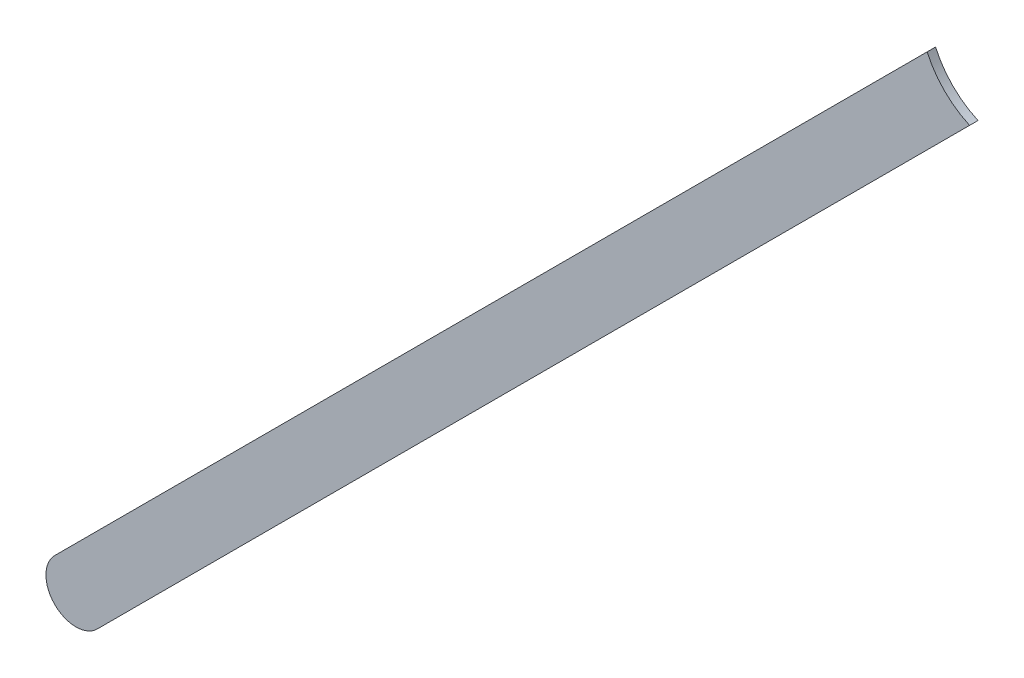
ISO-10303-21;
HEADER;
FILE_DESCRIPTION(('STEP AP214'),'2;1');
FILE_NAME('part.step','',(''),(''),'','','');
FILE_SCHEMA(('AUTOMOTIVE_DESIGN { 1 0 10303 214 1 1 1 1 }'));
ENDSEC;
DATA;
#1=APPLICATION_CONTEXT('core data for automotive mechanical design processes');
#2=APPLICATION_PROTOCOL_DEFINITION('international standard','automotive_design',2000,#1);
#3=PRODUCT_CONTEXT('',#1,'mechanical');
#4=PRODUCT('Part','Part','',(#3));
#5=PRODUCT_RELATED_PRODUCT_CATEGORY('part','',(#4));
#6=PRODUCT_DEFINITION_FORMATION('','',#4);
#7=PRODUCT_DEFINITION_CONTEXT('part definition',#1,'design');
#8=PRODUCT_DEFINITION('design','',#6,#7);
#9=PRODUCT_DEFINITION_SHAPE('','',#8);
#10=(LENGTH_UNIT() NAMED_UNIT(*) SI_UNIT(.MILLI.,.METRE.));
#11=(NAMED_UNIT(*) PLANE_ANGLE_UNIT() SI_UNIT($,.RADIAN.));
#12=(NAMED_UNIT(*) SI_UNIT($,.STERADIAN.) SOLID_ANGLE_UNIT());
#13=UNCERTAINTY_MEASURE_WITH_UNIT(LENGTH_MEASURE(1.E-05),#10,'distance_accuracy_value','');
#14=(GEOMETRIC_REPRESENTATION_CONTEXT(3) GLOBAL_UNCERTAINTY_ASSIGNED_CONTEXT((#13)) GLOBAL_UNIT_ASSIGNED_CONTEXT((#10,
#11,#12)) REPRESENTATION_CONTEXT('',''));
#15=CARTESIAN_POINT('',(0.,0.,0.));
#16=DIRECTION('',(0.,0.,1.));
#17=DIRECTION('',(1.,0.,0.));
#18=AXIS2_PLACEMENT_3D('',#15,#16,#17);
#19=CARTESIAN_POINT('',(88.98081264,98.67120728,0.));
#20=DIRECTION('',(-0.707107009926758,0.707106552446264,0.));
#21=DIRECTION('',(0.707106552446264,0.707107009926758,0.));
#22=AXIS2_PLACEMENT_3D('',#19,#20,#21);
#23=PLANE('',#22);
#24=DIRECTION('',(0.707106552446264,0.707107009926758,0.));
#25=VECTOR('',#24,1.);
#26=CARTESIAN_POINT('',(88.98081264,98.67120728,0.03556));
#27=LINE('',#26,#25);
#28=CARTESIAN_POINT('',(88.98081264,98.67120728,0.03556));
#29=VERTEX_POINT('',#28);
#30=CARTESIAN_POINT('',(92.671909402222,102.362306430271,0.03556));
#31=VERTEX_POINT('',#30);
#32=EDGE_CURVE('E11',#29,#31,#27,.T.);
#33=ORIENTED_EDGE('',*,*,#32,.F.);
#34=DIRECTION('',(0.,0.,1.));
#35=VECTOR('',#34,1.);
#36=CARTESIAN_POINT('',(88.98081264,98.67120728,0.));
#37=LINE('',#36,#35);
#38=CARTESIAN_POINT('',(88.98081264,98.67120728,0.));
#39=VERTEX_POINT('',#38);
#40=EDGE_CURVE('E24',#39,#29,#37,.T.);
#41=ORIENTED_EDGE('',*,*,#40,.F.);
#42=DIRECTION('',(0.707106552446264,0.707107009926758,0.));
#43=VECTOR('',#42,1.);
#44=CARTESIAN_POINT('',(88.98081264,98.67120728,0.));
#45=LINE('',#44,#43);
#46=CARTESIAN_POINT('',(92.671909402222,102.362306430271,0.));
#47=VERTEX_POINT('',#46);
#48=EDGE_CURVE('E75',#39,#47,#45,.T.);
#49=ORIENTED_EDGE('',*,*,#48,.T.);
#50=DIRECTION('',(0.,0.,1.));
#51=VECTOR('',#50,1.);
#52=CARTESIAN_POINT('',(92.671909402222,102.362306430271,0.));
#53=LINE('',#52,#51);
#54=EDGE_CURVE('E37',#47,#31,#53,.T.);
#55=ORIENTED_EDGE('',*,*,#54,.T.);
#56=EDGE_LOOP('',(#33,#41,#49,#55));
#57=FACE_BOUND('',#56,.T.);
#58=ADVANCED_FACE('F17',(#57),#23,.F.);
#59=CARTESIAN_POINT('',(92.8169721,102.68697268,0.));
#60=DIRECTION('',(0.,0.,-1.));
#61=DIRECTION('',(1.,0.,0.));
#62=AXIS2_PLACEMENT_3D('',#59,#60,#61);
#63=CYLINDRICAL_SURFACE('',#62,0.3556);
#64=DIRECTION('',(0.,0.,1.));
#65=VECTOR('',#64,1.);
#66=CARTESIAN_POINT('',(92.4923058502706,102.541909982222,0.));
#67=LINE('',#66,#65);
#68=CARTESIAN_POINT('',(92.4923058502706,102.541909982222,0.));
#69=VERTEX_POINT('',#68);
#70=CARTESIAN_POINT('',(92.4923058502706,102.541909982222,0.03556));
#71=VERTEX_POINT('',#70);
#72=EDGE_CURVE('E67',#69,#71,#67,.T.);
#73=ORIENTED_EDGE('',*,*,#72,.T.);
#74=CARTESIAN_POINT('',(92.8169721,102.68697268,0.03556));
#75=DIRECTION('',(0.,0.,1.));
#76=DIRECTION('',(1.,0.,0.));
#77=AXIS2_PLACEMENT_3D('',#74,#75,#76);
#78=CIRCLE('',#77,0.3556);
#79=EDGE_CURVE('E82',#71,#31,#78,.T.);
#80=ORIENTED_EDGE('',*,*,#79,.T.);
#81=ORIENTED_EDGE('',*,*,#54,.F.);
#82=CARTESIAN_POINT('',(92.8169721,102.68697268,0.));
#83=DIRECTION('',(0.,0.,1.));
#84=DIRECTION('',(1.,0.,0.));
#85=AXIS2_PLACEMENT_3D('',#82,#83,#84);
#86=CIRCLE('',#85,0.3556);
#87=EDGE_CURVE('E80',#69,#47,#86,.T.);
#88=ORIENTED_EDGE('',*,*,#87,.F.);
#89=EDGE_LOOP('',(#73,#80,#81,#88));
#90=FACE_BOUND('',#89,.T.);
#91=ADVANCED_FACE('F88',(#90),#63,.F.);
#92=CARTESIAN_POINT('',(92.4923058502706,102.541909982222,0.));
#93=DIRECTION('',(0.707106552446264,-0.707107009926758,0.));
#94=DIRECTION('',(-0.707107009926758,-0.707106552446264,0.));
#95=AXIS2_PLACEMENT_3D('',#92,#93,#94);
#96=PLANE('',#95);
#97=DIRECTION('',(-0.707107009926758,-0.707106552446264,0.));
#98=VECTOR('',#97,1.);
#99=CARTESIAN_POINT('',(92.7271704,102.77677438,0.03556));
#100=LINE('',#99,#98);
#101=CARTESIAN_POINT('',(88.8012067,98.85081322,0.03556));
#102=VERTEX_POINT('',#101);
#103=EDGE_CURVE('E71',#71,#102,#100,.T.);
#104=ORIENTED_EDGE('',*,*,#103,.F.);
#105=ORIENTED_EDGE('',*,*,#72,.F.);
#106=DIRECTION('',(-0.707107009926758,-0.707106552446264,0.));
#107=VECTOR('',#106,1.);
#108=CARTESIAN_POINT('',(92.7271704,102.77677438,0.));
#109=LINE('',#108,#107);
#110=CARTESIAN_POINT('',(88.8012067,98.85081322,0.));
#111=VERTEX_POINT('',#110);
#112=EDGE_CURVE('E63',#69,#111,#109,.T.);
#113=ORIENTED_EDGE('',*,*,#112,.T.);
#114=DIRECTION('',(0.,0.,1.));
#115=VECTOR('',#114,1.);
#116=CARTESIAN_POINT('',(88.8012067,98.85081322,0.));
#117=LINE('',#116,#115);
#118=EDGE_CURVE('E53',#111,#102,#117,.T.);
#119=ORIENTED_EDGE('',*,*,#118,.T.);
#120=EDGE_LOOP('',(#104,#105,#113,#119));
#121=FACE_BOUND('',#120,.T.);
#122=ADVANCED_FACE('F66',(#121),#96,.F.);
#123=CARTESIAN_POINT('',(88.89100967,98.76101025,0.));
#124=DIRECTION('',(0.,0.,-1.));
#125=DIRECTION('',(-0.707106781186492,0.707106781186604,0.));
#126=AXIS2_PLACEMENT_3D('',#123,#124,#125);
#127=CYLINDRICAL_SURFACE('',#126,0.127000578115389);
#128=CARTESIAN_POINT('',(88.89100967,98.76101025,0.03556));
#129=DIRECTION('',(0.,0.,1.));
#130=DIRECTION('',(-0.707106781186492,0.707106781186604,0.));
#131=AXIS2_PLACEMENT_3D('',#128,#129,#130);
#132=CIRCLE('',#131,0.127000578115389);
#133=EDGE_CURVE('E59',#102,#29,#132,.T.);
#134=ORIENTED_EDGE('',*,*,#133,.F.);
#135=ORIENTED_EDGE('',*,*,#118,.F.);
#136=CARTESIAN_POINT('',(88.89100967,98.76101025,0.));
#137=DIRECTION('',(0.,0.,1.));
#138=DIRECTION('',(-0.707106781186492,0.707106781186604,0.));
#139=AXIS2_PLACEMENT_3D('',#136,#137,#138);
#140=CIRCLE('',#139,0.127000578115389);
#141=EDGE_CURVE('E57',#111,#39,#140,.T.);
#142=ORIENTED_EDGE('',*,*,#141,.T.);
#143=ORIENTED_EDGE('',*,*,#40,.T.);
#144=EDGE_LOOP('',(#134,#135,#142,#143));
#145=FACE_BOUND('',#144,.T.);
#146=ADVANCED_FACE('F55',(#145),#127,.T.);
#147=CARTESIAN_POINT('',(88.98081264,98.67120728,0.));
#148=DIRECTION('',(0.,0.,-1.));
#149=DIRECTION('',(-1.,0.,0.));
#150=AXIS2_PLACEMENT_3D('',#147,#148,#149);
#151=PLANE('',#150);
#152=ORIENTED_EDGE('',*,*,#48,.F.);
#153=ORIENTED_EDGE('',*,*,#141,.F.);
#154=ORIENTED_EDGE('',*,*,#112,.F.);
#155=ORIENTED_EDGE('',*,*,#87,.T.);
#156=EDGE_LOOP('',(#152,#153,#154,#155));
#157=FACE_BOUND('',#156,.T.);
#158=ADVANCED_FACE('F74',(#157),#151,.T.);
#159=CARTESIAN_POINT('',(88.98081264,98.67120728,0.03556));
#160=DIRECTION('',(0.,0.,-1.));
#161=DIRECTION('',(-1.,0.,0.));
#162=AXIS2_PLACEMENT_3D('',#159,#160,#161);
#163=PLANE('',#162);
#164=ORIENTED_EDGE('',*,*,#133,.T.);
#165=ORIENTED_EDGE('',*,*,#32,.T.);
#166=ORIENTED_EDGE('',*,*,#79,.F.);
#167=ORIENTED_EDGE('',*,*,#103,.T.);
#168=EDGE_LOOP('',(#164,#165,#166,#167));
#169=FACE_BOUND('',#168,.T.);
#170=ADVANCED_FACE('F91',(#169),#163,.F.);
#171=CLOSED_SHELL('',(#58,#91,#122,#146,#158,#170));
#172=MANIFOLD_SOLID_BREP('B1',#171);
#173=ADVANCED_BREP_SHAPE_REPRESENTATION('',(#18,#172),#14);
#174=SHAPE_DEFINITION_REPRESENTATION(#9,#173);
ENDSEC;
END-ISO-10303-21;
